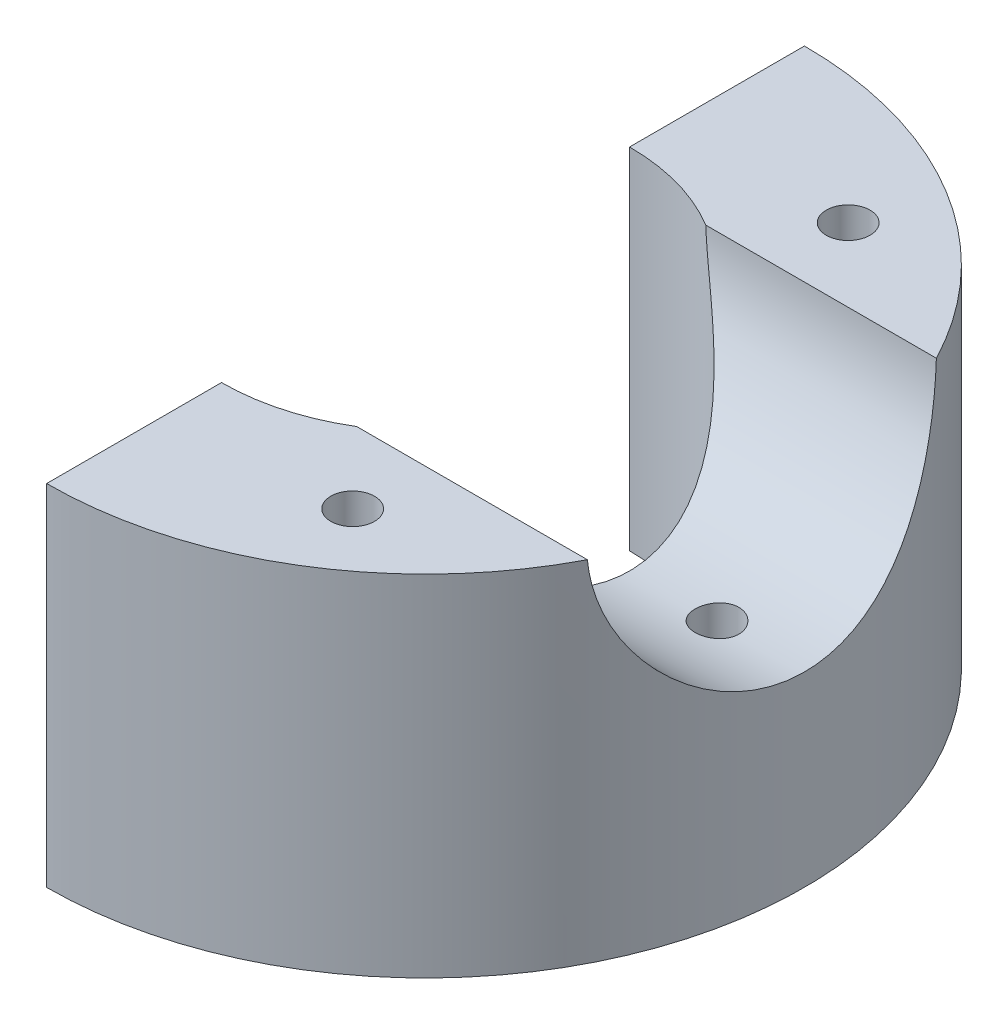
ISO-10303-21;
HEADER;
FILE_DESCRIPTION(('STEP AP214'),'2;1');
FILE_NAME('part.step','',(''),(''),'','','');
FILE_SCHEMA(('AUTOMOTIVE_DESIGN { 1 0 10303 214 1 1 1 1 }'));
ENDSEC;
DATA;
#1=APPLICATION_CONTEXT('core data for automotive mechanical design processes');
#2=APPLICATION_PROTOCOL_DEFINITION('international standard','automotive_design',2000,#1);
#3=PRODUCT_CONTEXT('',#1,'mechanical');
#4=PRODUCT('Part','Part','',(#3));
#5=PRODUCT_RELATED_PRODUCT_CATEGORY('part','',(#4));
#6=PRODUCT_DEFINITION_FORMATION('','',#4);
#7=PRODUCT_DEFINITION_CONTEXT('part definition',#1,'design');
#8=PRODUCT_DEFINITION('design','',#6,#7);
#9=PRODUCT_DEFINITION_SHAPE('','',#8);
#10=(LENGTH_UNIT() NAMED_UNIT(*) SI_UNIT(.MILLI.,.METRE.));
#11=(NAMED_UNIT(*) PLANE_ANGLE_UNIT() SI_UNIT($,.RADIAN.));
#12=(NAMED_UNIT(*) SI_UNIT($,.STERADIAN.) SOLID_ANGLE_UNIT());
#13=UNCERTAINTY_MEASURE_WITH_UNIT(LENGTH_MEASURE(1.E-05),#10,'distance_accuracy_value','');
#14=(GEOMETRIC_REPRESENTATION_CONTEXT(3) GLOBAL_UNCERTAINTY_ASSIGNED_CONTEXT((#13)) GLOBAL_UNIT_ASSIGNED_CONTEXT((#10,
#11,#12)) REPRESENTATION_CONTEXT('',''));
#15=CARTESIAN_POINT('',(0.,0.,0.));
#16=DIRECTION('',(0.,0.,1.));
#17=DIRECTION('',(1.,0.,0.));
#18=AXIS2_PLACEMENT_3D('',#15,#16,#17);
#19=CARTESIAN_POINT('',(0.,76.2,0.));
#20=DIRECTION('',(0.,1.,0.));
#21=DIRECTION('',(0.,0.,1.));
#22=AXIS2_PLACEMENT_3D('',#19,#20,#21);
#23=PLANE('',#22);
#24=CARTESIAN_POINT('',(38.1,76.2,-53.975));
#25=DIRECTION('',(0.,1.,0.));
#26=DIRECTION('',(0.,0.,1.));
#27=AXIS2_PLACEMENT_3D('',#24,#25,#26);
#28=CIRCLE('',#27,4.7625);
#29=CARTESIAN_POINT('',(38.1,76.2,-49.2125));
#30=VERTEX_POINT('',#29);
#31=EDGE_CURVE('E245',#30,#30,#28,.T.);
#32=ORIENTED_EDGE('',*,*,#31,.F.);
#33=EDGE_LOOP('',(#32));
#34=FACE_BOUND('',#33,.T.);
#35=DIRECTION('',(-1.,0.,0.));
#36=VECTOR('',#35,1.);
#37=CARTESIAN_POINT('',(82.55,76.2,-38.0152390496232));
#38=LINE('',#37,#36);
#39=CARTESIAN_POINT('',(73.2758084226984,76.2,-38.0152390496232));
#40=VERTEX_POINT('',#39);
#41=CARTESIAN_POINT('',(23.0357135769656,76.2,-38.0152390496232));
#42=VERTEX_POINT('',#41);
#43=EDGE_CURVE('E11',#40,#42,#38,.T.);
#44=ORIENTED_EDGE('',*,*,#43,.F.);
#45=CARTESIAN_POINT('',(0.,76.2,0.));
#46=DIRECTION('',(0.,1.,0.));
#47=DIRECTION('',(0.,0.,1.));
#48=AXIS2_PLACEMENT_3D('',#45,#46,#47);
#49=CIRCLE('',#48,82.55);
#50=CARTESIAN_POINT('',(0.,76.2,-82.55));
#51=VERTEX_POINT('',#50);
#52=EDGE_CURVE('E108',#40,#51,#49,.T.);
#53=ORIENTED_EDGE('',*,*,#52,.T.);
#54=DIRECTION('',(0.,0.,1.));
#55=VECTOR('',#54,1.);
#56=CARTESIAN_POINT('',(0.,76.2,-82.55));
#57=LINE('',#56,#55);
#58=CARTESIAN_POINT('',(0.,76.2,-44.45));
#59=VERTEX_POINT('',#58);
#60=EDGE_CURVE('E62',#51,#59,#57,.T.);
#61=ORIENTED_EDGE('',*,*,#60,.T.);
#62=CARTESIAN_POINT('',(0.,76.2,0.));
#63=DIRECTION('',(0.,-1.,0.));
#64=DIRECTION('',(0.,0.,1.));
#65=AXIS2_PLACEMENT_3D('',#62,#63,#64);
#66=CIRCLE('',#65,44.45);
#67=EDGE_CURVE('E148',#59,#42,#66,.T.);
#68=ORIENTED_EDGE('',*,*,#67,.T.);
#69=EDGE_LOOP('',(#44,#53,#61,#68));
#70=FACE_BOUND('',#69,.T.);
#71=ADVANCED_FACE('F33',(#34,#70),#23,.T.);
#72=CARTESIAN_POINT('',(0.,76.2,0.));
#73=DIRECTION('',(0.,-1.,0.));
#74=DIRECTION('',(0.,0.,-1.));
#75=AXIS2_PLACEMENT_3D('',#72,#73,#74);
#76=CYLINDRICAL_SURFACE('',#75,44.45);
#77=CARTESIAN_POINT('',(23.0357135769656,76.2,38.0152390496232));
#78=VERTEX_POINT('',#77);
#79=CARTESIAN_POINT('',(0.,76.2,44.45));
#80=VERTEX_POINT('',#79);
#81=EDGE_CURVE('E90',#78,#80,#66,.T.);
#82=ORIENTED_EDGE('',*,*,#81,.F.);
#83=CARTESIAN_POINT('',(23.0357135769656,76.2,38.0152390496232));
#84=CARTESIAN_POINT('',(23.0768786435621,75.8262826747996,37.9902821408491));
#85=CARTESIAN_POINT('',(23.1269567733437,75.4539701804877,37.9598579369916));
#86=CARTESIAN_POINT('',(23.2438130041999,74.7131446121529,37.8884229280671));
#87=CARTESIAN_POINT('',(23.3105844352429,74.3446300816911,37.8474163511183));
#88=CARTESIAN_POINT('',(23.4595088366594,73.6132049928737,37.7552844994611));
#89=CARTESIAN_POINT('',(23.5416143935481,73.2502807963263,37.7041903885507));
#90=CARTESIAN_POINT('',(23.7200575303529,72.5294784785993,37.5921864630771));
#91=CARTESIAN_POINT('',(23.816396543846,72.1716008696879,37.5312756597322));
#92=CARTESIAN_POINT('',(24.1221496031307,71.1153103071732,37.3360728313197));
#93=CARTESIAN_POINT('',(24.3502964671482,70.4247628914725,37.1880968192933));
#94=CARTESIAN_POINT('',(24.8469875381372,69.0662750765978,36.8580863792057));
#95=CARTESIAN_POINT('',(25.1155703751131,68.3983570517963,36.6760193417279));
#96=CARTESIAN_POINT('',(25.61805735395,67.2378819873664,36.3261408641506));
#97=CARTESIAN_POINT('',(25.8455721952137,66.7405591534253,36.1648049571366));
#98=CARTESIAN_POINT('',(26.3155448114192,65.7592061121662,35.8242766638025));
#99=CARTESIAN_POINT('',(26.5580045374053,65.275177652394,35.645081944135));
#100=CARTESIAN_POINT('',(27.0548312748846,64.3199489596881,35.2694711191298));
#101=CARTESIAN_POINT('',(27.309201214973,63.8487519273926,35.073050767717));
#102=CARTESIAN_POINT('',(27.827153232985,62.9189120848734,34.663542339373));
#103=CARTESIAN_POINT('',(28.090734961213,62.4602687992634,34.4504548947746));
#104=CARTESIAN_POINT('',(28.8959679196134,61.0954984469948,33.7833250140768));
#105=CARTESIAN_POINT('',(29.4482827207679,60.2077347218597,33.3042625138627));
#106=CARTESIAN_POINT('',(30.5657070764361,58.4791090317433,32.2817956736816));
#107=CARTESIAN_POINT('',(31.130814686376,57.6382400049366,31.7384010601193));
#108=CARTESIAN_POINT('',(32.3005214460119,55.946817213324,30.5486647177652));
#109=CARTESIAN_POINT('',(32.9052039862203,55.0994621172525,29.8978438975478));
#110=CARTESIAN_POINT('',(34.1037521500438,53.4578416954261,28.5231266337174));
#111=CARTESIAN_POINT('',(34.6976165233923,52.6635824780504,27.7992218061698));
#112=CARTESIAN_POINT('',(35.8616984583801,51.1335810226186,26.2802852257515));
#113=CARTESIAN_POINT('',(36.4319865350007,50.39765716756,25.4854920346065));
#114=CARTESIAN_POINT('',(37.2630200780988,49.3395315933666,24.2387994232944));
#115=CARTESIAN_POINT('',(37.5359482648247,48.9944702402641,23.814180124695));
#116=CARTESIAN_POINT('',(38.0724955672012,48.3202010501935,22.9466284793784));
#117=CARTESIAN_POINT('',(38.3361123594122,47.9909971627328,22.5036916209677));
#118=CARTESIAN_POINT('',(39.013164214641,47.1499729449374,21.3187221344503));
#119=CARTESIAN_POINT('',(39.4178932819546,46.651806402579,20.5618811434569));
#120=CARTESIAN_POINT('',(40.1931550003168,45.7040889307597,19.0018774167612));
#121=CARTESIAN_POINT('',(40.5636950421056,45.2545274905676,18.1987247536745));
#122=CARTESIAN_POINT('',(41.2647779407561,44.4085941478699,16.5476564852845));
#123=CARTESIAN_POINT('',(41.5953097384506,44.0122369489135,15.6997285957207));
#124=CARTESIAN_POINT('',(42.2101459604871,43.2781313031769,13.9626313086566));
#125=CARTESIAN_POINT('',(42.494449961155,42.9403833935442,13.0734615332739));
#126=CARTESIAN_POINT('',(43.0133988974202,42.3258906277797,11.2497341473868));
#127=CARTESIAN_POINT('',(43.2475449639659,42.0497575572617,10.3148248506342));
#128=CARTESIAN_POINT('',(43.5546833040286,41.6883887039125,8.88981244849701));
#129=CARTESIAN_POINT('',(43.6497297736128,41.5767214112884,8.41094078061985));
#130=CARTESIAN_POINT('',(43.8245456489626,41.3715480258187,7.44658548753607));
#131=CARTESIAN_POINT('',(43.9043171376096,41.2780394568427,6.96110277348929));
#132=CARTESIAN_POINT('',(44.047988635709,41.1097632730583,5.98501283174213));
#133=CARTESIAN_POINT('',(44.1119021636767,41.034979695161,5.49441034294247));
#134=CARTESIAN_POINT('',(44.2235021674318,40.9044771618335,4.50890619037503));
#135=CARTESIAN_POINT('',(44.2711908423883,40.8487556226671,4.01400511858427));
#136=CARTESIAN_POINT('',(44.3500092877166,40.7566958613877,3.02111304044764));
#137=CARTESIAN_POINT('',(44.38114019764,40.720356305352,2.52312224913196));
#138=CARTESIAN_POINT('',(44.4266272866646,40.6672684817039,1.52538790179442));
#139=CARTESIAN_POINT('',(44.440984158708,40.6505194048011,1.02564441903244));
#140=CARTESIAN_POINT('',(44.4569543551743,40.6318851369579,-0.325992676660799));
#141=CARTESIAN_POINT('',(44.4425131248547,40.6487274386105,-1.17846429917812));
#142=CARTESIAN_POINT('',(44.364894903994,40.7393168708645,-2.87792314749163));
#143=CARTESIAN_POINT('',(44.3017236880992,40.8130572588761,-3.72491101113758));
#144=CARTESIAN_POINT('',(44.1279868777854,41.0161416171441,-5.40724587845434));
#145=CARTESIAN_POINT('',(44.0174222113802,41.1454844986452,-6.24259310973035));
#146=CARTESIAN_POINT('',(43.7511014253966,41.4576583198564,-7.89587422699149));
#147=CARTESIAN_POINT('',(43.5953437184254,41.6404911383872,-8.71380750023288));
#148=CARTESIAN_POINT('',(43.246111678191,42.0515126563429,-10.3064992258255));
#149=CARTESIAN_POINT('',(43.0537092242692,42.2784153268344,-11.0818270264968));
#150=CARTESIAN_POINT('',(42.6319481906902,42.7774044110873,-12.6073712157991));
#151=CARTESIAN_POINT('',(42.4025915087285,43.0494885046873,-13.3575888915121));
#152=CARTESIAN_POINT('',(41.9102816322215,43.6358042258146,-14.8301641728117));
#153=CARTESIAN_POINT('',(41.6473196629921,43.9500468624392,-15.55251443757));
#154=CARTESIAN_POINT('',(41.0913257724773,44.6175925010109,-16.967118886486));
#155=CARTESIAN_POINT('',(40.7982877745934,44.970903397478,-17.6593669483758));
#156=CARTESIAN_POINT('',(40.2731612524048,45.6075760795183,-18.8190502495728));
#157=CARTESIAN_POINT('',(40.0475282254835,45.8821458415942,-19.2942907370139));
#158=CARTESIAN_POINT('',(39.5840912755216,46.4486037838571,-20.2280469423226));
#159=CARTESIAN_POINT('',(39.3462896339414,46.740488719292,-20.6865657678803));
#160=CARTESIAN_POINT('',(38.6162611574835,47.6410123710371,-22.0371078412686));
#161=CARTESIAN_POINT('',(38.1075006800238,48.274411389662,-22.9039201391575));
#162=CARTESIAN_POINT('',(37.0552231533657,49.6013517231602,-24.5700195579205));
#163=CARTESIAN_POINT('',(36.5116490241991,50.2949925085686,-25.3691905238623));
#164=CARTESIAN_POINT('',(35.4001607457575,51.736487364165,-26.8984057067354));
#165=CARTESIAN_POINT('',(34.8322493257095,52.4843353619294,-27.6284576454829));
#166=CARTESIAN_POINT('',(33.6713861553522,54.0449220391957,-29.0324830277737));
#167=CARTESIAN_POINT('',(33.078166802566,54.8585938692368,-29.7051943333696));
#168=CARTESIAN_POINT('',(31.8874569302702,56.5371108962249,-30.9798757652927));
#169=CARTESIAN_POINT('',(31.2899656171983,57.4019658301909,-31.5818323658577));
#170=CARTESIAN_POINT('',(30.4002998297436,58.7376146433778,-32.4313563899802));
#171=CARTESIAN_POINT('',(30.1047592678269,59.1893550314843,-32.7056974514789));
#172=CARTESIAN_POINT('',(29.5177894324037,60.1058533168902,-33.2364111477656));
#173=CARTESIAN_POINT('',(29.2263598058272,60.5706100859083,-33.4927853332464));
#174=CARTESIAN_POINT('',(28.6498135629585,61.5133245419489,-33.9872751009336));
#175=CARTESIAN_POINT('',(28.3646949452971,61.9912779327406,-34.2253965322733));
#176=CARTESIAN_POINT('',(27.8031627464322,62.960914921993,-34.6831062981302));
#177=CARTESIAN_POINT('',(27.5267484120614,63.4525973255203,-34.9026962389242));
#178=CARTESIAN_POINT('',(26.9006070529287,64.6065862767429,-35.3887284892542));
#179=CARTESIAN_POINT('',(26.5550423881321,65.2740883792061,-35.6482960575406));
#180=CARTESIAN_POINT('',(25.8915061990969,66.6350207759163,-36.1331050252946));
#181=CARTESIAN_POINT('',(25.5735377576295,67.3284539545722,-36.3583425918811));
#182=CARTESIAN_POINT('',(24.9764272532694,68.7382563517896,-36.7710703756788));
#183=CARTESIAN_POINT('',(24.69708644146,69.4544829043249,-36.9587562228755));
#184=CARTESIAN_POINT('',(24.1866728163754,70.9126003313613,-37.2947829560971));
#185=CARTESIAN_POINT('',(23.9555640315517,71.6544715951556,-37.4431531862274));
#186=CARTESIAN_POINT('',(23.5902284563055,73.0251410544039,-37.6741510468615));
#187=CARTESIAN_POINT('',(23.4460336290491,73.6500566378844,-37.7638207495217));
#188=CARTESIAN_POINT('',(23.2647957088493,74.5981261886019,-37.8755437600178));
#189=CARTESIAN_POINT('',(23.2101446341242,74.9166401981648,-37.9090359374736));
#190=CARTESIAN_POINT('',(23.1133619638423,75.5564158429064,-37.9681196261842));
#191=CARTESIAN_POINT('',(23.0712352544046,75.87767850026,-37.9937080541075));
#192=CARTESIAN_POINT('',(23.0357135769656,76.2,-38.0152390496232));
#193=B_SPLINE_CURVE_WITH_KNOTS('',3,(#83,#84,#85,#86,#87,#88,#89,#90,#91,#92,#93,#94,#95,#96,
#97,#98,#99,#100,#101,#102,#103,#104,#105,#106,#107,#108,#109,#110,#111,#112,#113,#114,#115,
#116,#117,#118,#119,#120,#121,#122,#123,#124,#125,#126,#127,#128,#129,#130,#131,#132,#133,#134,
#135,#136,#137,#138,#139,#140,#141,#142,#143,#144,#145,#146,#147,#148,#149,#150,#151,#152,#153,
#154,#155,#156,#157,#158,#159,#160,#161,#162,#163,#164,#165,#166,#167,#168,#169,#170,#171,#172,
#173,#174,#175,#176,#177,#178,#179,#180,#181,#182,#183,#184,#185,#186,#187,#188,#189,#190,#191,
#192),.UNSPECIFIED.,.F.,.F.,(4,2,2,2,2,2,2,2,2,2,2,2,2,2,2,2,2,2,2,2,2,2,2,2,2,2,2,2,2,2,2,2,2,
2,2,2,2,2,2,2,2,2,2,2,2,2,2,2,2,2,2,2,2,2,4),(0.,1.13018332451942,2.25991578889317,
3.38621125253202,4.51262023274801,6.73626862344242,8.96205498956032,10.6719899781595,
12.3821486723245,14.0927301076024,15.8032466765751,19.2501271450902,22.696487141935,
26.3761782456921,30.0562919510711,33.7244572753805,35.5583069242123,37.3926109801178,
40.3668611146224,43.3404667831156,46.3148925541665,49.2893455840554,52.2921342106832,
53.7940972460685,55.295855329167,56.7963287681596,58.296598747016,59.796765459738,
61.2968701977876,63.8515734118972,66.4059739326763,68.9603244378797,71.5147646747867,
74.0035733608884,76.4922542809152,78.9815863537709,81.4714223681676,83.2510901549562,
85.03042549053,88.5898191475936,92.1552060343012,95.720194133146,99.3500515115277,
102.98060166381,104.796877550396,106.612996483507,108.428530983153,110.243907953494,
112.62802897875,115.012415992023,117.384037862093,119.753884600309,121.694113375001,
122.668497573278,123.643261409845),.UNSPECIFIED.);
#194=EDGE_CURVE('E53',#78,#42,#193,.T.);
#195=ORIENTED_EDGE('',*,*,#194,.T.);
#196=ORIENTED_EDGE('',*,*,#67,.F.);
#197=DIRECTION('',(0.,-1.,0.));
#198=VECTOR('',#197,1.);
#199=CARTESIAN_POINT('',(0.,76.2,-44.45));
#200=LINE('',#199,#198);
#201=CARTESIAN_POINT('',(0.,0.,-44.45));
#202=VERTEX_POINT('',#201);
#203=EDGE_CURVE('E118',#59,#202,#200,.T.);
#204=ORIENTED_EDGE('',*,*,#203,.T.);
#205=CARTESIAN_POINT('',(0.,0.,0.));
#206=DIRECTION('',(0.,-1.,0.));
#207=DIRECTION('',(0.,0.,1.));
#208=AXIS2_PLACEMENT_3D('',#205,#206,#207);
#209=CIRCLE('',#208,44.45);
#210=CARTESIAN_POINT('',(0.,0.,44.45));
#211=VERTEX_POINT('',#210);
#212=EDGE_CURVE('E123',#202,#211,#209,.T.);
#213=ORIENTED_EDGE('',*,*,#212,.T.);
#214=DIRECTION('',(0.,-1.,0.));
#215=VECTOR('',#214,1.);
#216=CARTESIAN_POINT('',(0.,76.2,44.45));
#217=LINE('',#216,#215);
#218=EDGE_CURVE('E112',#80,#211,#217,.T.);
#219=ORIENTED_EDGE('',*,*,#218,.F.);
#220=EDGE_LOOP('',(#82,#195,#196,#204,#213,#219));
#221=FACE_BOUND('',#220,.T.);
#222=ADVANCED_FACE('F35',(#221),#76,.F.);
#223=CARTESIAN_POINT('',(0.,76.2,44.45));
#224=DIRECTION('',(1.,0.,0.));
#225=DIRECTION('',(0.,0.,-1.));
#226=AXIS2_PLACEMENT_3D('',#223,#224,#225);
#227=PLANE('',#226);
#228=CARTESIAN_POINT('',(0.,57.15,63.5));
#229=DIRECTION('',(-1.,0.,0.));
#230=DIRECTION('',(0.,0.,1.));
#231=AXIS2_PLACEMENT_3D('',#228,#229,#230);
#232=CIRCLE('',#231,6.35);
#233=CARTESIAN_POINT('',(0.,57.15,69.85));
#234=VERTEX_POINT('',#233);
#235=EDGE_CURVE('E156',#234,#234,#232,.T.);
#236=ORIENTED_EDGE('',*,*,#235,.F.);
#237=EDGE_LOOP('',(#236));
#238=FACE_BOUND('',#237,.T.);
#239=CARTESIAN_POINT('',(0.,19.05,63.5));
#240=DIRECTION('',(-1.,0.,0.));
#241=DIRECTION('',(0.,0.,1.));
#242=AXIS2_PLACEMENT_3D('',#239,#240,#241);
#243=CIRCLE('',#242,6.35);
#244=CARTESIAN_POINT('',(0.,19.05,69.85));
#245=VERTEX_POINT('',#244);
#246=EDGE_CURVE('E162',#245,#245,#243,.T.);
#247=ORIENTED_EDGE('',*,*,#246,.F.);
#248=EDGE_LOOP('',(#247));
#249=FACE_BOUND('',#248,.T.);
#250=DIRECTION('',(0.,0.,1.));
#251=VECTOR('',#250,1.);
#252=CARTESIAN_POINT('',(0.,0.,44.45));
#253=LINE('',#252,#251);
#254=CARTESIAN_POINT('',(0.,0.,82.55));
#255=VERTEX_POINT('',#254);
#256=EDGE_CURVE('E126',#211,#255,#253,.T.);
#257=ORIENTED_EDGE('',*,*,#256,.T.);
#258=DIRECTION('',(0.,-1.,0.));
#259=VECTOR('',#258,1.);
#260=CARTESIAN_POINT('',(0.,76.2,82.55));
#261=LINE('',#260,#259);
#262=CARTESIAN_POINT('',(0.,76.2,82.55));
#263=VERTEX_POINT('',#262);
#264=EDGE_CURVE('E135',#263,#255,#261,.T.);
#265=ORIENTED_EDGE('',*,*,#264,.F.);
#266=DIRECTION('',(0.,0.,1.));
#267=VECTOR('',#266,1.);
#268=CARTESIAN_POINT('',(0.,76.2,44.45));
#269=LINE('',#268,#267);
#270=EDGE_CURVE('E115',#80,#263,#269,.T.);
#271=ORIENTED_EDGE('',*,*,#270,.F.);
#272=ORIENTED_EDGE('',*,*,#218,.T.);
#273=EDGE_LOOP('',(#257,#265,#271,#272));
#274=FACE_BOUND('',#273,.T.);
#275=ADVANCED_FACE('F140',(#238,#249,#274),#227,.F.);
#276=CARTESIAN_POINT('',(0.,76.2,0.));
#277=DIRECTION('',(0.,-1.,0.));
#278=DIRECTION('',(0.,0.,-1.));
#279=AXIS2_PLACEMENT_3D('',#276,#277,#278);
#280=CYLINDRICAL_SURFACE('',#279,82.55);
#281=ORIENTED_EDGE('',*,*,#52,.F.);
#282=CARTESIAN_POINT('',(73.2758084226984,76.2,-38.0152390496232));
#283=CARTESIAN_POINT('',(73.2935682203748,75.6871689209393,-37.9809850002956));
#284=CARTESIAN_POINT('',(73.316707410549,75.1752314244165,-37.9363454780884));
#285=CARTESIAN_POINT('',(73.3734493891736,74.1541795202166,-37.8264943451136));
#286=CARTESIAN_POINT('',(73.4070515771177,73.6450649522286,-37.7612839149764));
#287=CARTESIAN_POINT('',(73.4844027384989,72.6309468785505,-37.6105320985142));
#288=CARTESIAN_POINT('',(73.5281454750418,72.1259410426211,-37.5250032081605));
#289=CARTESIAN_POINT('',(73.6253726671658,71.1207212734573,-37.3338780176365));
#290=CARTESIAN_POINT('',(73.6788572362123,70.6205073961074,-37.2282814837331));
#291=CARTESIAN_POINT('',(73.8526723172195,69.1332357178121,-36.8829505475193));
#292=CARTESIAN_POINT('',(73.9867655584467,68.1543914919271,-36.6139043178954));
#293=CARTESIAN_POINT('',(74.2872017414978,66.2258383978289,-36.0004236143479));
#294=CARTESIAN_POINT('',(74.4535488985188,65.2761333565653,-35.655979286044));
#295=CARTESIAN_POINT('',(74.8128685732309,63.4133579668857,-34.8957507895726));
#296=CARTESIAN_POINT('',(75.0057814428937,62.5002113019292,-34.4801259475086));
#297=CARTESIAN_POINT('',(75.3110226964061,61.1602652531325,-33.8055202274835));
#298=CARTESIAN_POINT('',(75.4154190254794,60.7185640018996,-33.5721145407357));
#299=CARTESIAN_POINT('',(75.6288194196045,59.8454236533422,-33.0885787691721));
#300=CARTESIAN_POINT('',(75.7378244109154,59.4139866464381,-32.8384453164403));
#301=CARTESIAN_POINT('',(76.0708885806586,58.1350086900358,-32.0630490866492));
#302=CARTESIAN_POINT('',(76.3007886609562,57.3037045135857,-31.5132459707082));
#303=CARTESIAN_POINT('',(76.7702400436827,55.6884338982076,-30.3516889385109));
#304=CARTESIAN_POINT('',(77.0097919115078,54.9044702392011,-29.7399313898134));
#305=CARTESIAN_POINT('',(77.3808358507127,53.7389972077349,-28.7548945039511));
#306=CARTESIAN_POINT('',(77.5109756270527,53.3392985470578,-28.4024323848455));
#307=CARTESIAN_POINT('',(77.7714683747758,52.5551665115441,-27.6811889747951));
#308=CARTESIAN_POINT('',(77.9018212913572,52.1707297086823,-27.3124113883311));
#309=CARTESIAN_POINT('',(78.2919797035428,51.0408768758592,-26.1821207769312));
#310=CARTESIAN_POINT('',(78.5508983256412,50.3188765793448,-25.3966145284086));
#311=CARTESIAN_POINT('',(79.0594962817041,48.9419986565712,-23.7661102916082));
#312=CARTESIAN_POINT('',(79.3091751965686,48.2871240726605,-22.9211096097809));
#313=CARTESIAN_POINT('',(79.7928553402199,47.0488004178467,-21.1759864292018));
#314=CARTESIAN_POINT('',(80.0268565855667,46.465351271498,-20.275863988676));
#315=CARTESIAN_POINT('',(80.4787980105885,45.3602861281437,-18.4015898698355));
#316=CARTESIAN_POINT('',(80.6961670760189,44.8406569896226,-17.4261264371023));
#317=CARTESIAN_POINT('',(81.1017705634333,43.8861421802872,-15.428665840605));
#318=CARTESIAN_POINT('',(81.2900041397571,43.4512589691365,-14.4066673272695));
#319=CARTESIAN_POINT('',(81.6317021358125,42.6711039083672,-12.3239822111646));
#320=CARTESIAN_POINT('',(81.7851854301795,42.3257833978111,-11.2633169754928));
#321=CARTESIAN_POINT('',(82.0528150965459,41.7286051538577,-9.11116666223305));
#322=CARTESIAN_POINT('',(82.1669652926572,41.4767383343576,-8.01968459194372));
#323=CARTESIAN_POINT('',(82.3450785065756,41.0856884116619,-5.90169827313726));
#324=CARTESIAN_POINT('',(82.4122736843117,40.9392210230544,-4.876805718463));
#325=CARTESIAN_POINT('',(82.508372514895,40.7301626837439,-2.81672775227257));
#326=CARTESIAN_POINT('',(82.5372782108083,40.6675672577639,-1.78154289290728));
#327=CARTESIAN_POINT('',(82.5559891503004,40.6270212255644,0.290545882819311));
#328=CARTESIAN_POINT('',(82.5458050884673,40.6490474676585,1.32744925142201));
#329=CARTESIAN_POINT('',(82.4866448131115,40.7774219074201,3.39488909816314));
#330=CARTESIAN_POINT('',(82.4376695483597,40.8837680427578,4.4254257314005));
#331=CARTESIAN_POINT('',(82.3062164249572,41.1709176273416,6.41272502652068));
#332=CARTESIAN_POINT('',(82.2258409265214,41.3470570820323,7.37030630851127));
#333=CARTESIAN_POINT('',(82.0338260405616,41.7712041530828,9.26615388790402));
#334=CARTESIAN_POINT('',(81.9221881849298,42.0192082480115,10.2044211292991));
#335=CARTESIAN_POINT('',(81.6702622123867,42.5847337710849,12.0558612874294));
#336=CARTESIAN_POINT('',(81.5299717178707,42.9022609684355,12.9690321145173));
#337=CARTESIAN_POINT('',(81.223941069224,43.6040387792563,14.7649519574583));
#338=CARTESIAN_POINT('',(81.0581998400953,43.9882922112251,15.6476996863594));
#339=CARTESIAN_POINT('',(80.6982186944981,44.8362699741343,17.4109177263675));
#340=CARTESIAN_POINT('',(80.5031362632069,45.3024558451498,18.2900316199903));
#341=CARTESIAN_POINT('',(80.0939828819835,46.299894851523,20.0058600953384));
#342=CARTESIAN_POINT('',(79.8799116086852,46.8311490950061,20.8425739546407));
#343=CARTESIAN_POINT('',(79.4375163757675,47.9553675200449,22.4698623793075));
#344=CARTESIAN_POINT('',(79.2091878758089,48.5483514004693,23.2604220897874));
#345=CARTESIAN_POINT('',(78.7433928313388,49.7924251345062,24.7915523541915));
#346=CARTESIAN_POINT('',(78.5059258644727,50.4435176755798,25.5321205932806));
#347=CARTESIAN_POINT('',(78.0064726270727,51.8589155861501,27.0215026688972));
#348=CARTESIAN_POINT('',(77.7441364777019,52.6281419488933,27.7655303411456));
#349=CARTESIAN_POINT('',(77.221842030495,54.2269185944175,29.1866909063237));
#350=CARTESIAN_POINT('',(76.9618838975825,55.0564730259819,29.8638191909911));
#351=CARTESIAN_POINT('',(76.4513060790921,56.7722744272149,31.1476808860221));
#352=CARTESIAN_POINT('',(76.2006944455803,57.6585685709826,31.7543545087746));
#353=CARTESIAN_POINT('',(75.7163668062989,59.4825729990677,32.8925054349538));
#354=CARTESIAN_POINT('',(75.4826499729997,60.4202807611168,33.423986422637));
#355=CARTESIAN_POINT('',(75.034535525344,62.363126443964,34.4183824727523));
#356=CARTESIAN_POINT('',(74.820676406214,63.3692942900214,34.8795307501457));
#357=CARTESIAN_POINT('',(74.425753006031,65.4240068437491,35.7144725921545));
#358=CARTESIAN_POINT('',(74.2446955037078,66.4725602561158,36.0882481050763));
#359=CARTESIAN_POINT('',(74.0032452911814,68.0692769054993,36.5794349417747));
#360=CARTESIAN_POINT('',(73.9278628509371,68.604787254485,36.7314322387332));
#361=CARTESIAN_POINT('',(73.7877482546374,69.6832413940297,37.0120978889202));
#362=CARTESIAN_POINT('',(73.7230147327064,70.2261842215754,37.1407692342507));
#363=CARTESIAN_POINT('',(73.6049202363415,71.3179937950112,37.3742599731621));
#364=CARTESIAN_POINT('',(73.5515514972267,71.8668562253828,37.4790956551524));
#365=CARTESIAN_POINT('',(73.4567113595986,72.9695941065535,37.6646376285814));
#366=CARTESIAN_POINT('',(73.4152379461656,73.5234686919407,37.7453480066433));
#367=CARTESIAN_POINT('',(73.3575603715897,74.4315385314413,37.857274200943));
#368=CARTESIAN_POINT('',(73.3376633462717,74.7846187834373,37.8957932563288));
#369=CARTESIAN_POINT('',(73.3029301800127,75.4916551217377,37.9629328758908));
#370=CARTESIAN_POINT('',(73.2880896337242,75.8456101736453,37.9915620567086));
#371=CARTESIAN_POINT('',(73.2758084226984,76.2,38.0152390496232));
#372=B_SPLINE_CURVE_WITH_KNOTS('',3,(#282,#283,#284,#285,#286,#287,#288,#289,#290,#291,#292,
#293,#294,#295,#296,#297,#298,#299,#300,#301,#302,#303,#304,#305,#306,#307,#308,#309,#310,#311,
#312,#313,#314,#315,#316,#317,#318,#319,#320,#321,#322,#323,#324,#325,#326,#327,#328,#329,#330,
#331,#332,#333,#334,#335,#336,#337,#338,#339,#340,#341,#342,#343,#344,#345,#346,#347,#348,#349,
#350,#351,#352,#353,#354,#355,#356,#357,#358,#359,#360,#361,#362,#363,#364,#365,#366,#367,#368,
#369,#370,#371),.UNSPECIFIED.,.F.,.F.,(4,2,2,2,2,2,2,2,2,2,2,2,2,2,2,2,2,2,2,2,2,2,2,2,2,2,2,2,
2,2,2,2,2,2,2,2,2,2,2,2,2,2,2,2,4),(0.,1.54268619339372,3.0852838631912,4.62693527132437,
6.16860463657168,9.23631062400259,12.3044177941077,15.3657451734446,16.8965156954563,
18.4275953513276,21.4928456441404,24.5582757593497,26.2035638157746,27.8484802022755,
31.13814422138,34.4279572725391,37.7177668486838,41.0925678525365,44.4674667919457,
47.8405282319557,51.2132616376399,54.3216650561227,57.4299026084453,60.5372898369948,
63.6446010661625,66.572127889339,69.4995112853544,72.4271376953023,75.3548877975084,
78.3936891185152,81.4325421980153,84.4723680120072,87.5123344874992,90.8141980603524,
94.1162889186964,97.421161756256,100.725872606953,104.1033265515,107.481477681073,
109.16619084914,110.850687759955,112.534030064789,114.217087063822,115.284122188883,
116.350225291377),.UNSPECIFIED.);
#373=CARTESIAN_POINT('',(73.2758084226984,76.2,38.0152390496232));
#374=VERTEX_POINT('',#373);
#375=EDGE_CURVE('E102',#40,#374,#372,.T.);
#376=ORIENTED_EDGE('',*,*,#375,.T.);
#377=EDGE_CURVE('E106',#263,#374,#49,.T.);
#378=ORIENTED_EDGE('',*,*,#377,.F.);
#379=ORIENTED_EDGE('',*,*,#264,.T.);
#380=CARTESIAN_POINT('',(0.,0.,0.));
#381=DIRECTION('',(0.,1.,0.));
#382=DIRECTION('',(0.,0.,1.));
#383=AXIS2_PLACEMENT_3D('',#380,#381,#382);
#384=CIRCLE('',#383,82.55);
#385=CARTESIAN_POINT('',(0.,0.,-82.55));
#386=VERTEX_POINT('',#385);
#387=EDGE_CURVE('E129',#255,#386,#384,.T.);
#388=ORIENTED_EDGE('',*,*,#387,.T.);
#389=DIRECTION('',(0.,-1.,0.));
#390=VECTOR('',#389,1.);
#391=CARTESIAN_POINT('',(0.,76.2,-82.55));
#392=LINE('',#391,#390);
#393=EDGE_CURVE('E133',#51,#386,#392,.T.);
#394=ORIENTED_EDGE('',*,*,#393,.F.);
#395=EDGE_LOOP('',(#281,#376,#378,#379,#388,#394));
#396=FACE_BOUND('',#395,.T.);
#397=ADVANCED_FACE('F103',(#396),#280,.T.);
#398=CARTESIAN_POINT('',(0.,76.2,-82.55));
#399=DIRECTION('',(1.,0.,0.));
#400=DIRECTION('',(0.,0.,-1.));
#401=AXIS2_PLACEMENT_3D('',#398,#399,#400);
#402=PLANE('',#401);
#403=CARTESIAN_POINT('',(0.,19.05,-63.5));
#404=DIRECTION('',(-1.,0.,0.));
#405=DIRECTION('',(0.,0.,1.));
#406=AXIS2_PLACEMENT_3D('',#403,#404,#405);
#407=CIRCLE('',#406,6.35);
#408=CARTESIAN_POINT('',(0.,19.05,-57.15));
#409=VERTEX_POINT('',#408);
#410=EDGE_CURVE('E168',#409,#409,#407,.T.);
#411=ORIENTED_EDGE('',*,*,#410,.F.);
#412=EDGE_LOOP('',(#411));
#413=FACE_BOUND('',#412,.T.);
#414=CARTESIAN_POINT('',(0.,57.15,-63.5));
#415=DIRECTION('',(-1.,0.,0.));
#416=DIRECTION('',(0.,0.,1.));
#417=AXIS2_PLACEMENT_3D('',#414,#415,#416);
#418=CIRCLE('',#417,6.35);
#419=CARTESIAN_POINT('',(0.,57.15,-57.15));
#420=VERTEX_POINT('',#419);
#421=EDGE_CURVE('E150',#420,#420,#418,.T.);
#422=ORIENTED_EDGE('',*,*,#421,.F.);
#423=EDGE_LOOP('',(#422));
#424=FACE_BOUND('',#423,.T.);
#425=DIRECTION('',(0.,0.,1.));
#426=VECTOR('',#425,1.);
#427=CARTESIAN_POINT('',(0.,0.,-82.55));
#428=LINE('',#427,#426);
#429=EDGE_CURVE('E83',#386,#202,#428,.T.);
#430=ORIENTED_EDGE('',*,*,#429,.T.);
#431=ORIENTED_EDGE('',*,*,#203,.F.);
#432=ORIENTED_EDGE('',*,*,#60,.F.);
#433=ORIENTED_EDGE('',*,*,#393,.T.);
#434=EDGE_LOOP('',(#430,#431,#432,#433));
#435=FACE_BOUND('',#434,.T.);
#436=ADVANCED_FACE('F147',(#413,#424,#435),#402,.F.);
#437=CARTESIAN_POINT('',(38.1,76.2,53.975));
#438=DIRECTION('',(0.,1.,0.));
#439=DIRECTION('',(0.,0.,1.));
#440=AXIS2_PLACEMENT_3D('',#437,#438,#439);
#441=CIRCLE('',#440,4.7625);
#442=CARTESIAN_POINT('',(38.1,76.2,58.7375));
#443=VERTEX_POINT('',#442);
#444=EDGE_CURVE('E250',#443,#443,#441,.T.);
#445=ORIENTED_EDGE('',*,*,#444,.F.);
#446=EDGE_LOOP('',(#445));
#447=FACE_BOUND('',#446,.T.);
#448=DIRECTION('',(-1.,0.,0.));
#449=VECTOR('',#448,1.);
#450=CARTESIAN_POINT('',(82.55,76.2,38.0152390496232));
#451=LINE('',#450,#449);
#452=EDGE_CURVE('E47',#78,#374,#451,.F.);
#453=ORIENTED_EDGE('',*,*,#452,.F.);
#454=ORIENTED_EDGE('',*,*,#81,.T.);
#455=ORIENTED_EDGE('',*,*,#270,.T.);
#456=ORIENTED_EDGE('',*,*,#377,.T.);
#457=EDGE_LOOP('',(#453,#454,#455,#456));
#458=FACE_BOUND('',#457,.T.);
#459=ADVANCED_FACE('F114',(#447,#458),#23,.T.);
#460=CARTESIAN_POINT('',(0.,0.,0.));
#461=DIRECTION('',(0.,1.,0.));
#462=DIRECTION('',(0.,0.,1.));
#463=AXIS2_PLACEMENT_3D('',#460,#461,#462);
#464=PLANE('',#463);
#465=CARTESIAN_POINT('',(63.5,0.,0.));
#466=DIRECTION('',(0.,-1.,0.));
#467=DIRECTION('',(0.,0.,-1.));
#468=AXIS2_PLACEMENT_3D('',#465,#466,#467);
#469=CIRCLE('',#468,4.7625);
#470=CARTESIAN_POINT('',(63.5,0.,-4.7625));
#471=VERTEX_POINT('',#470);
#472=EDGE_CURVE('E253',#471,#471,#469,.T.);
#473=ORIENTED_EDGE('',*,*,#472,.F.);
#474=EDGE_LOOP('',(#473));
#475=FACE_BOUND('',#474,.T.);
#476=ORIENTED_EDGE('',*,*,#212,.F.);
#477=ORIENTED_EDGE('',*,*,#429,.F.);
#478=ORIENTED_EDGE('',*,*,#387,.F.);
#479=ORIENTED_EDGE('',*,*,#256,.F.);
#480=EDGE_LOOP('',(#476,#477,#478,#479));
#481=FACE_BOUND('',#480,.T.);
#482=ADVANCED_FACE('F145',(#475,#481),#464,.F.);
#483=CARTESIAN_POINT('',(28.575,57.15,-63.5));
#484=DIRECTION('',(-1.,0.,0.));
#485=DIRECTION('',(0.,0.,1.));
#486=AXIS2_PLACEMENT_3D('',#483,#484,#485);
#487=CYLINDRICAL_SURFACE('',#486,6.35);
#488=CARTESIAN_POINT('',(28.575,57.15,-63.5));
#489=DIRECTION('',(-1.,0.,0.));
#490=DIRECTION('',(0.,0.,1.));
#491=AXIS2_PLACEMENT_3D('',#488,#489,#490);
#492=CIRCLE('',#491,6.35);
#493=CARTESIAN_POINT('',(28.575,57.15,-57.15));
#494=VERTEX_POINT('',#493);
#495=EDGE_CURVE('E127',#494,#494,#492,.T.);
#496=ORIENTED_EDGE('',*,*,#495,.F.);
#497=EDGE_LOOP('',(#496));
#498=FACE_BOUND('',#497,.T.);
#499=ORIENTED_EDGE('',*,*,#421,.T.);
#500=EDGE_LOOP('',(#499));
#501=FACE_BOUND('',#500,.T.);
#502=ADVANCED_FACE('F217',(#498,#501),#487,.F.);
#503=CARTESIAN_POINT('',(28.575,57.15,-63.5));
#504=DIRECTION('',(-1.,0.,0.));
#505=DIRECTION('',(0.,0.,1.));
#506=AXIS2_PLACEMENT_3D('',#503,#504,#505);
#507=PLANE('',#506);
#508=ORIENTED_EDGE('',*,*,#495,.T.);
#509=EDGE_LOOP('',(#508));
#510=FACE_BOUND('',#509,.T.);
#511=ADVANCED_FACE('F199',(#510),#507,.T.);
#512=CARTESIAN_POINT('',(28.575,19.05,-63.5));
#513=DIRECTION('',(-1.,0.,0.));
#514=DIRECTION('',(0.,0.,1.));
#515=AXIS2_PLACEMENT_3D('',#512,#513,#514);
#516=CYLINDRICAL_SURFACE('',#515,6.35);
#517=CARTESIAN_POINT('',(28.575,19.05,-63.5));
#518=DIRECTION('',(-1.,0.,0.));
#519=DIRECTION('',(0.,0.,1.));
#520=AXIS2_PLACEMENT_3D('',#517,#518,#519);
#521=CIRCLE('',#520,6.35);
#522=CARTESIAN_POINT('',(28.575,19.05,-57.15));
#523=VERTEX_POINT('',#522);
#524=EDGE_CURVE('E153',#523,#523,#521,.T.);
#525=ORIENTED_EDGE('',*,*,#524,.F.);
#526=EDGE_LOOP('',(#525));
#527=FACE_BOUND('',#526,.T.);
#528=ORIENTED_EDGE('',*,*,#410,.T.);
#529=EDGE_LOOP('',(#528));
#530=FACE_BOUND('',#529,.T.);
#531=ADVANCED_FACE('F195',(#527,#530),#516,.F.);
#532=CARTESIAN_POINT('',(28.575,19.05,-63.5));
#533=DIRECTION('',(-1.,0.,0.));
#534=DIRECTION('',(0.,0.,1.));
#535=AXIS2_PLACEMENT_3D('',#532,#533,#534);
#536=PLANE('',#535);
#537=ORIENTED_EDGE('',*,*,#524,.T.);
#538=EDGE_LOOP('',(#537));
#539=FACE_BOUND('',#538,.T.);
#540=ADVANCED_FACE('F189',(#539),#536,.T.);
#541=CARTESIAN_POINT('',(28.575,19.05,63.5));
#542=DIRECTION('',(-1.,0.,0.));
#543=DIRECTION('',(0.,0.,1.));
#544=AXIS2_PLACEMENT_3D('',#541,#542,#543);
#545=CYLINDRICAL_SURFACE('',#544,6.35);
#546=CARTESIAN_POINT('',(28.575,19.05,63.5));
#547=DIRECTION('',(-1.,0.,0.));
#548=DIRECTION('',(0.,0.,1.));
#549=AXIS2_PLACEMENT_3D('',#546,#547,#548);
#550=CIRCLE('',#549,6.35);
#551=CARTESIAN_POINT('',(28.575,19.05,69.85));
#552=VERTEX_POINT('',#551);
#553=EDGE_CURVE('E165',#552,#552,#550,.T.);
#554=ORIENTED_EDGE('',*,*,#553,.F.);
#555=EDGE_LOOP('',(#554));
#556=FACE_BOUND('',#555,.T.);
#557=ORIENTED_EDGE('',*,*,#246,.T.);
#558=EDGE_LOOP('',(#557));
#559=FACE_BOUND('',#558,.T.);
#560=ADVANCED_FACE('F194',(#556,#559),#545,.F.);
#561=CARTESIAN_POINT('',(28.575,19.05,63.5));
#562=DIRECTION('',(-1.,0.,0.));
#563=DIRECTION('',(0.,0.,1.));
#564=AXIS2_PLACEMENT_3D('',#561,#562,#563);
#565=PLANE('',#564);
#566=ORIENTED_EDGE('',*,*,#553,.T.);
#567=EDGE_LOOP('',(#566));
#568=FACE_BOUND('',#567,.T.);
#569=ADVANCED_FACE('F201',(#568),#565,.T.);
#570=CARTESIAN_POINT('',(28.575,57.15,63.5));
#571=DIRECTION('',(-1.,0.,0.));
#572=DIRECTION('',(0.,0.,1.));
#573=AXIS2_PLACEMENT_3D('',#570,#571,#572);
#574=CYLINDRICAL_SURFACE('',#573,6.35);
#575=CARTESIAN_POINT('',(28.575,57.15,63.5));
#576=DIRECTION('',(-1.,0.,0.));
#577=DIRECTION('',(0.,0.,1.));
#578=AXIS2_PLACEMENT_3D('',#575,#576,#577);
#579=CIRCLE('',#578,6.35);
#580=CARTESIAN_POINT('',(28.575,57.15,69.85));
#581=VERTEX_POINT('',#580);
#582=EDGE_CURVE('E159',#581,#581,#579,.T.);
#583=ORIENTED_EDGE('',*,*,#582,.F.);
#584=EDGE_LOOP('',(#583));
#585=FACE_BOUND('',#584,.T.);
#586=ORIENTED_EDGE('',*,*,#235,.T.);
#587=EDGE_LOOP('',(#586));
#588=FACE_BOUND('',#587,.T.);
#589=ADVANCED_FACE('F204',(#585,#588),#574,.F.);
#590=CARTESIAN_POINT('',(28.575,57.15,63.5));
#591=DIRECTION('',(-1.,0.,0.));
#592=DIRECTION('',(0.,0.,1.));
#593=AXIS2_PLACEMENT_3D('',#590,#591,#592);
#594=PLANE('',#593);
#595=ORIENTED_EDGE('',*,*,#582,.T.);
#596=EDGE_LOOP('',(#595));
#597=FACE_BOUND('',#596,.T.);
#598=ADVANCED_FACE('F185',(#597),#594,.T.);
#599=CARTESIAN_POINT('',(82.55,78.74,0.));
#600=DIRECTION('',(-1.,0.,0.));
#601=DIRECTION('',(0.,0.,1.));
#602=AXIS2_PLACEMENT_3D('',#599,#600,#601);
#603=CYLINDRICAL_SURFACE('',#602,38.1);
#604=CARTESIAN_POINT('',(63.5,40.9388281431647,-4.7625));
#605=CARTESIAN_POINT('',(63.6332395126259,40.9388286706819,-4.76250152999193));
#606=CARTESIAN_POINT('',(63.7664565768555,40.9381222666162,-4.7569065784066));
#607=CARTESIAN_POINT('',(64.0319828691593,40.9353179613888,-4.73456956858263));
#608=CARTESIAN_POINT('',(64.1642918662924,40.9332197186025,-4.71782477362909));
#609=CARTESIAN_POINT('',(64.4271066636853,40.9276892774456,-4.67329207860049));
#610=CARTESIAN_POINT('',(64.5576110637895,40.9242560975335,-4.64549605252855));
#611=CARTESIAN_POINT('',(64.8158407224083,40.9161534198275,-4.57905551491443));
#612=CARTESIAN_POINT('',(64.9435649440725,40.9114834690558,-4.54040702825331));
#613=CARTESIAN_POINT('',(65.1951481710781,40.9010473317784,-4.45259608525345));
#614=CARTESIAN_POINT('',(65.3190111062835,40.8952823052217,-4.40344474714157));
#615=CARTESIAN_POINT('',(65.5621903107895,40.8828148161958,-4.29494019274976));
#616=CARTESIAN_POINT('',(65.6815048855892,40.8761120086146,-4.23558321885335));
#617=CARTESIAN_POINT('',(65.9146448236285,40.8619645463207,-4.10714012880825));
#618=CARTESIAN_POINT('',(66.0284731549933,40.8545202995753,-4.0380593545023));
#619=CARTESIAN_POINT('',(66.2499647123435,40.8390938430873,-3.89060501493726));
#620=CARTESIAN_POINT('',(66.3576256338227,40.8311114346499,-3.81222800921762));
#621=CARTESIAN_POINT('',(66.566477476048,40.8147974690484,-3.64636620964802));
#622=CARTESIAN_POINT('',(66.6676361192744,40.8064644659462,-3.55884091174532));
#623=CARTESIAN_POINT('',(66.8622680257999,40.7897162894891,-3.37556438783685));
#624=CARTESIAN_POINT('',(66.9557384328705,40.781301086884,-3.279810131493));
#625=CARTESIAN_POINT('',(67.1342715390002,40.7646313514713,-3.08080175741128));
#626=CARTESIAN_POINT('',(67.219336901393,40.7563767684378,-2.97755003352863));
#627=CARTESIAN_POINT('',(67.3805254349716,40.7402547715453,-2.76420209218442));
#628=CARTESIAN_POINT('',(67.4566452960739,40.7323875016247,-2.65410336404119));
#629=CARTESIAN_POINT('',(67.5995798504526,40.7172426549776,-2.42751660242973));
#630=CARTESIAN_POINT('',(67.6663664594862,40.7099668844567,-2.3110106953786));
#631=CARTESIAN_POINT('',(67.7898992433618,40.6962347047213,-2.07273147163289));
#632=CARTESIAN_POINT('',(67.8466416830682,40.6897786005683,-1.95095621628168));
#633=CARTESIAN_POINT('',(68.0010798340292,40.6719332852425,-1.57909446342224));
#634=CARTESIAN_POINT('',(68.0831482756408,40.6620492620422,-1.32221491050737));
#635=CARTESIAN_POINT('',(68.2024974655387,40.6474998274292,-0.799673170573942));
#636=CARTESIAN_POINT('',(68.2400105256666,40.6428073561197,-0.534064025917232));
#637=CARTESIAN_POINT('',(68.2699915306276,40.639065933886,-0.000244773652957554));
#638=CARTESIAN_POINT('',(68.262461247507,40.6400167609494,0.267965231219952));
#639=CARTESIAN_POINT('',(68.2027316679901,40.6474360206969,0.797750515325372));
#640=CARTESIAN_POINT('',(68.1507818513956,40.6538736364947,1.05935446460168));
#641=CARTESIAN_POINT('',(68.00408412551,40.6715076850232,1.5701044046057));
#642=CARTESIAN_POINT('',(67.9093354025952,40.6827042082222,1.8192501583983));
#643=CARTESIAN_POINT('',(67.6794624842804,40.7086512751138,2.29878048646143));
#644=CARTESIAN_POINT('',(67.5442303356386,40.7234113006291,2.52911277577723));
#645=CARTESIAN_POINT('',(67.2373082923627,40.7548339929637,2.96390839490042));
#646=CARTESIAN_POINT('',(67.0656167256895,40.7714967470265,3.16837053760918));
#647=CARTESIAN_POINT('',(66.6892522930437,40.8049945726872,3.54708721262741));
#648=CARTESIAN_POINT('',(66.4843620300657,40.8218300436546,3.72112573395048));
#649=CARTESIAN_POINT('',(66.0481631323274,40.8536634297974,4.0323760766827));
#650=CARTESIAN_POINT('',(65.8168544147604,40.8686613392128,4.16958778265638));
#651=CARTESIAN_POINT('',(65.3341921114886,40.895121360156,4.40330191370302));
#652=CARTESIAN_POINT('',(65.0828300578251,40.9065819679286,4.49978703173894));
#653=CARTESIAN_POINT('',(64.5672963408955,40.9246404804735,4.64911755141053));
#654=CARTESIAN_POINT('',(64.3031252956131,40.9312386195925,4.7019650561764));
#655=CARTESIAN_POINT('',(63.7713802382992,40.9387823186498,4.76223412316025));
#656=CARTESIAN_POINT('',(63.5038411979167,40.9397657051879,4.76995968015259));
#657=CARTESIAN_POINT('',(62.9712826240865,40.9360686017056,4.74056764475839));
#658=CARTESIAN_POINT('',(62.7062630370582,40.9313882324077,4.70345100818024));
#659=CARTESIAN_POINT('',(62.1871773199802,40.9169254972551,4.58568416363943));
#660=CARTESIAN_POINT('',(61.9330772715477,40.9071603867024,4.50518115714888));
#661=CARTESIAN_POINT('',(61.4419824865194,40.8836424525205,4.30307821930306));
#662=CARTESIAN_POINT('',(61.2049883512608,40.8698894887884,4.18147684403849));
#663=CARTESIAN_POINT('',(60.7534573978517,40.8398548559793,3.89988181077153));
#664=CARTESIAN_POINT('',(60.5390457813085,40.8235602168432,3.73968880190003));
#665=CARTESIAN_POINT('',(60.1400437860221,40.7903189930687,3.3857386450987));
#666=CARTESIAN_POINT('',(59.9554545677815,40.7733723830915,3.1919801916178));
#667=CARTESIAN_POINT('',(59.6202689432855,40.7406203860533,2.77507485500371));
#668=CARTESIAN_POINT('',(59.4698722900869,40.7248220544372,2.55176675549978));
#669=CARTESIAN_POINT('',(59.2087244941703,40.6962525882753,2.08287169014904));
#670=CARTESIAN_POINT('',(59.097972552343,40.683481392714,1.8372851734882));
#671=CARTESIAN_POINT('',(58.9195830037476,40.662435022331,1.33151855984817));
#672=CARTESIAN_POINT('',(58.8518299614405,40.6541478186177,1.07137959378993));
#673=CARTESIAN_POINT('',(58.7610040554553,40.6429586933666,0.543160531455597));
#674=CARTESIAN_POINT('',(58.7379291769715,40.6400565289853,0.275080793829973));
#675=CARTESIAN_POINT('',(58.7372948962034,40.6399729293682,-0.125902504122627));
#676=CARTESIAN_POINT('',(58.7426822276014,40.6406486010853,-0.258990376106115));
#677=CARTESIAN_POINT('',(58.764572927471,40.6433765727312,-0.524221174556772));
#678=CARTESIAN_POINT('',(58.7810721553712,40.6454283598837,-0.656364434480907));
#679=CARTESIAN_POINT('',(58.8250773101323,40.650854200799,-0.918817188433489));
#680=CARTESIAN_POINT('',(58.8525872331043,40.6542287346169,-1.04912599889169));
#681=CARTESIAN_POINT('',(58.9183959895338,40.6622030343878,-1.30690335741431));
#682=CARTESIAN_POINT('',(58.9566908972388,40.6668023544833,-1.43437292078468));
#683=CARTESIAN_POINT('',(59.043794715719,40.6770982300449,-1.68562159802998));
#684=CARTESIAN_POINT('',(59.0926036869329,40.6827947918182,-1.80940069068605));
#685=CARTESIAN_POINT('',(59.2003629857525,40.6951237362425,-2.05236000094921));
#686=CARTESIAN_POINT('',(59.2593096309773,40.7017557789353,-2.17154186926144));
#687=CARTESIAN_POINT('',(59.3869595744893,40.7157752023784,-2.40457076210488));
#688=CARTESIAN_POINT('',(59.4556664417286,40.7231628591509,-2.51841581481722));
#689=CARTESIAN_POINT('',(59.6023094392858,40.7384832905791,-2.73989930464571));
#690=CARTESIAN_POINT('',(59.6802422487867,40.7464158686651,-2.84753995437759));
#691=CARTESIAN_POINT('',(59.8453836216317,40.7626644097614,-3.05664137852835));
#692=CARTESIAN_POINT('',(59.9326526252205,40.7709826453971,-3.15805424870355));
#693=CARTESIAN_POINT('',(60.1153724576605,40.7877138209682,-3.3531414751218));
#694=CARTESIAN_POINT('',(60.2108203089108,40.7961267254775,-3.44681862345587));
#695=CARTESIAN_POINT('',(60.4093205114053,40.8128183315689,-3.62587689195655));
#696=CARTESIAN_POINT('',(60.5123774266595,40.8210969489131,-3.71125296073249));
#697=CARTESIAN_POINT('',(60.7252878689535,40.8372776646352,-3.87301521470471));
#698=CARTESIAN_POINT('',(60.8351388721576,40.8451799009213,-3.94940470795098));
#699=CARTESIAN_POINT('',(61.0613869313205,40.8604192524024,-4.09299396673999));
#700=CARTESIAN_POINT('',(61.1778097869833,40.8677538272477,-4.16015336072185));
#701=CARTESIAN_POINT('',(61.4159079029935,40.8816070707698,-4.28438932708575));
#702=CARTESIAN_POINT('',(61.5375812218982,40.8881260376121,-4.34146958730117));
#703=CARTESIAN_POINT('',(61.785264432615,40.9001581735289,-4.44512024805028));
#704=CARTESIAN_POINT('',(61.9112708459129,40.9056721279894,-4.49169886209896));
#705=CARTESIAN_POINT('',(62.166766968992,40.9155396315377,-4.57404776941731));
#706=CARTESIAN_POINT('',(62.2962558487398,40.9198934544871,-4.6098206137713));
#707=CARTESIAN_POINT('',(62.6027289858738,40.928587619823,-4.68068368956188));
#708=CARTESIAN_POINT('',(62.7807732856656,40.9324113597467,-4.71133319913012));
#709=CARTESIAN_POINT('',(63.1392254479145,40.9375312547781,-4.7522402414126));
#710=CARTESIAN_POINT('',(63.3196332924283,40.938827429063,-4.76249792884558));
#711=CARTESIAN_POINT('',(63.5,40.9388281431647,-4.7625));
#712=B_SPLINE_CURVE_WITH_KNOTS('',3,(#604,#605,#606,#607,#608,#609,#610,#611,#612,#613,#614,
#615,#616,#617,#618,#619,#620,#621,#622,#623,#624,#625,#626,#627,#628,#629,#630,#631,#632,#633,
#634,#635,#636,#637,#638,#639,#640,#641,#642,#643,#644,#645,#646,#647,#648,#649,#650,#651,#652,
#653,#654,#655,#656,#657,#658,#659,#660,#661,#662,#663,#664,#665,#666,#667,#668,#669,#670,#671,
#672,#673,#674,#675,#676,#677,#678,#679,#680,#681,#682,#683,#684,#685,#686,#687,#688,#689,#690,
#691,#692,#693,#694,#695,#696,#697,#698,#699,#700,#701,#702,#703,#704,#705,#706,#707,#708,#709,
#710,#711),.UNSPECIFIED.,.T.,.F.,(4,2,2,2,2,2,2,2,2,2,2,2,2,2,2,2,2,2,2,2,2,2,2,2,2,2,2,2,2,2,2,
2,2,2,2,2,2,2,2,2,2,2,2,2,2,2,2,2,2,2,2,2,2,4),(0.,0.399560676736784,0.79921946130333,
1.19917266104732,1.59927255011431,1.99895097679637,2.39877687758102,2.79838398208073,
3.19813944214773,3.59974649271906,4.00150207525084,4.40312994115428,4.80490595566335,
5.20786603813904,5.61097565642115,6.41629353131856,7.21739378207955,8.01846251703536,
8.81506142731918,9.61167548189238,10.4104330044087,11.2092271660812,12.0134808453913,
12.8177370456448,13.6223346767229,14.4268935276702,15.2260256095469,16.0251406582763,
16.8215613787214,17.6180100827306,18.4186646726601,19.219350411596,20.0245999865939,
20.8298333294489,21.6328956820979,22.4359218190169,22.8351290005633,23.2341875097488,
23.6333909807445,24.0324493284015,24.4315099700559,24.830425963,25.2294882020511,
25.6284072355376,26.0300860076537,26.43161916042,26.8333951455077,27.2350227668857,
27.6383546699041,28.0415386914714,28.4444062735775,28.8471786700649,29.3880691996152,
29.9289556252543),.UNSPECIFIED.);
#713=CARTESIAN_POINT('',(63.5,40.9388281431647,-4.7625));
#714=VERTEX_POINT('',#713);
#715=EDGE_CURVE('E38',#714,#714,#712,.T.);
#716=ORIENTED_EDGE('',*,*,#715,.T.);
#717=EDGE_LOOP('',(#716));
#718=FACE_BOUND('',#717,.T.);
#719=ORIENTED_EDGE('',*,*,#43,.T.);
#720=ORIENTED_EDGE('',*,*,#194,.F.);
#721=ORIENTED_EDGE('',*,*,#452,.T.);
#722=ORIENTED_EDGE('',*,*,#375,.F.);
#723=EDGE_LOOP('',(#719,#720,#721,#722));
#724=FACE_BOUND('',#723,.T.);
#725=ADVANCED_FACE('F111',(#718,#724),#603,.F.);
#726=CARTESIAN_POINT('',(63.5,78.7442421795877,0.));
#727=DIRECTION('',(0.,-1.,0.));
#728=DIRECTION('',(0.,0.,-1.));
#729=AXIS2_PLACEMENT_3D('',#726,#727,#728);
#730=CYLINDRICAL_SURFACE('',#729,4.7625);
#731=ORIENTED_EDGE('',*,*,#472,.T.);
#732=EDGE_LOOP('',(#731));
#733=FACE_BOUND('',#732,.T.);
#734=ORIENTED_EDGE('',*,*,#715,.F.);
#735=EDGE_LOOP('',(#734));
#736=FACE_BOUND('',#735,.T.);
#737=ADVANCED_FACE('F184',(#733,#736),#730,.F.);
#738=CARTESIAN_POINT('',(38.1,47.625,53.975));
#739=DIRECTION('',(0.,1.,0.));
#740=DIRECTION('',(0.,0.,1.));
#741=AXIS2_PLACEMENT_3D('',#738,#739,#740);
#742=CYLINDRICAL_SURFACE('',#741,4.7625);
#743=CARTESIAN_POINT('',(38.1,47.625,53.975));
#744=DIRECTION('',(0.,1.,0.));
#745=DIRECTION('',(0.,0.,1.));
#746=AXIS2_PLACEMENT_3D('',#743,#744,#745);
#747=CIRCLE('',#746,4.7625);
#748=CARTESIAN_POINT('',(38.1,47.625,58.7375));
#749=VERTEX_POINT('',#748);
#750=EDGE_CURVE('E255',#749,#749,#747,.T.);
#751=ORIENTED_EDGE('',*,*,#750,.F.);
#752=EDGE_LOOP('',(#751));
#753=FACE_BOUND('',#752,.T.);
#754=ORIENTED_EDGE('',*,*,#444,.T.);
#755=EDGE_LOOP('',(#754));
#756=FACE_BOUND('',#755,.T.);
#757=ADVANCED_FACE('F266',(#753,#756),#742,.F.);
#758=CARTESIAN_POINT('',(38.1,47.625,53.975));
#759=DIRECTION('',(0.,1.,0.));
#760=DIRECTION('',(0.,0.,1.));
#761=AXIS2_PLACEMENT_3D('',#758,#759,#760);
#762=PLANE('',#761);
#763=ORIENTED_EDGE('',*,*,#750,.T.);
#764=EDGE_LOOP('',(#763));
#765=FACE_BOUND('',#764,.T.);
#766=ADVANCED_FACE('F268',(#765),#762,.T.);
#767=CARTESIAN_POINT('',(38.1,47.625,-53.975));
#768=DIRECTION('',(0.,1.,0.));
#769=DIRECTION('',(0.,0.,1.));
#770=AXIS2_PLACEMENT_3D('',#767,#768,#769);
#771=CYLINDRICAL_SURFACE('',#770,4.7625);
#772=CARTESIAN_POINT('',(38.1,47.625,-53.975));
#773=DIRECTION('',(0.,1.,0.));
#774=DIRECTION('',(0.,0.,1.));
#775=AXIS2_PLACEMENT_3D('',#772,#773,#774);
#776=CIRCLE('',#775,4.7625);
#777=CARTESIAN_POINT('',(38.1,47.625,-49.2125));
#778=VERTEX_POINT('',#777);
#779=EDGE_CURVE('E247',#778,#778,#776,.T.);
#780=ORIENTED_EDGE('',*,*,#779,.F.);
#781=EDGE_LOOP('',(#780));
#782=FACE_BOUND('',#781,.T.);
#783=ORIENTED_EDGE('',*,*,#31,.T.);
#784=EDGE_LOOP('',(#783));
#785=FACE_BOUND('',#784,.T.);
#786=ADVANCED_FACE('F275',(#782,#785),#771,.F.);
#787=CARTESIAN_POINT('',(38.1,47.625,-53.975));
#788=DIRECTION('',(0.,1.,0.));
#789=DIRECTION('',(0.,0.,1.));
#790=AXIS2_PLACEMENT_3D('',#787,#788,#789);
#791=PLANE('',#790);
#792=ORIENTED_EDGE('',*,*,#779,.T.);
#793=EDGE_LOOP('',(#792));
#794=FACE_BOUND('',#793,.T.);
#795=ADVANCED_FACE('F278',(#794),#791,.T.);
#796=CLOSED_SHELL('',(#71,#222,#275,#397,#436,#459,#482,#502,#511,#531,#540,#560,#569,#589,#598,
#725,#737,#757,#766,#786,#795));
#797=MANIFOLD_SOLID_BREP('B2',#796);
#798=ADVANCED_BREP_SHAPE_REPRESENTATION('',(#18,#797),#14);
#799=SHAPE_DEFINITION_REPRESENTATION(#9,#798);
ENDSEC;
END-ISO-10303-21;
